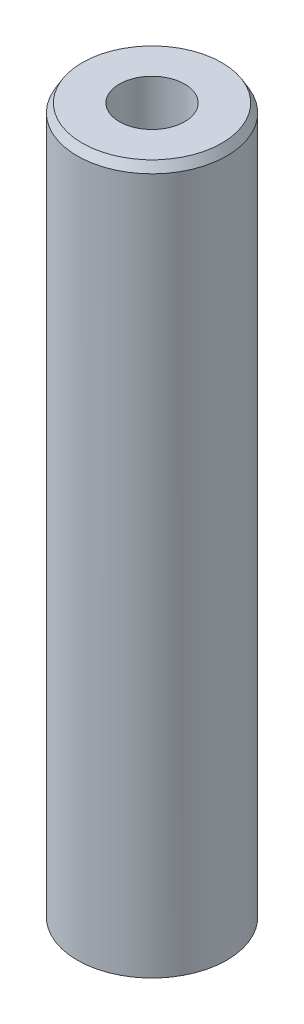
ISO-10303-21;
HEADER;
FILE_DESCRIPTION(('STEP AP214'),'2;1');
FILE_NAME('part.step','',(''),(''),'','','');
FILE_SCHEMA(('AUTOMOTIVE_DESIGN { 1 0 10303 214 1 1 1 1 }'));
ENDSEC;
DATA;
#1=APPLICATION_CONTEXT('core data for automotive mechanical design processes');
#2=APPLICATION_PROTOCOL_DEFINITION('international standard','automotive_design',2000,#1);
#3=PRODUCT_CONTEXT('',#1,'mechanical');
#4=PRODUCT('Part','Part','',(#3));
#5=PRODUCT_RELATED_PRODUCT_CATEGORY('part','',(#4));
#6=PRODUCT_DEFINITION_FORMATION('','',#4);
#7=PRODUCT_DEFINITION_CONTEXT('part definition',#1,'design');
#8=PRODUCT_DEFINITION('design','',#6,#7);
#9=PRODUCT_DEFINITION_SHAPE('','',#8);
#10=(LENGTH_UNIT() NAMED_UNIT(*) SI_UNIT(.MILLI.,.METRE.));
#11=(NAMED_UNIT(*) PLANE_ANGLE_UNIT() SI_UNIT($,.RADIAN.));
#12=(NAMED_UNIT(*) SI_UNIT($,.STERADIAN.) SOLID_ANGLE_UNIT());
#13=UNCERTAINTY_MEASURE_WITH_UNIT(LENGTH_MEASURE(1.E-05),#10,'distance_accuracy_value','');
#14=(GEOMETRIC_REPRESENTATION_CONTEXT(3) GLOBAL_UNCERTAINTY_ASSIGNED_CONTEXT((#13)) GLOBAL_UNIT_ASSIGNED_CONTEXT((#10,
#11,#12)) REPRESENTATION_CONTEXT('',''));
#15=CARTESIAN_POINT('',(0.,0.,0.));
#16=DIRECTION('',(0.,0.,1.));
#17=DIRECTION('',(1.,0.,0.));
#18=AXIS2_PLACEMENT_3D('',#15,#16,#17);
#19=CARTESIAN_POINT('',(0.,427.403267792067,0.));
#20=DIRECTION('',(0.,-1.,0.));
#21=DIRECTION('',(0.,0.,-1.));
#22=AXIS2_PLACEMENT_3D('',#19,#20,#21);
#23=CYLINDRICAL_SURFACE('',#22,45.);
#24=CARTESIAN_POINT('',(0.,422.217168382494,0.));
#25=DIRECTION('',(0.,1.,0.));
#26=DIRECTION('',(0.,0.,1.));
#27=AXIS2_PLACEMENT_3D('',#24,#25,#26);
#28=CIRCLE('',#27,45.);
#29=CARTESIAN_POINT('',(0.,422.217168382494,-45.));
#30=VERTEX_POINT('',#29);
#31=EDGE_CURVE('E50',#30,#30,#28,.F.);
#32=CARTESIAN_POINT('',(0.,2.99419589016137,0.));
#33=DIRECTION('',(0.,1.,0.));
#34=DIRECTION('',(0.,0.,1.));
#35=AXIS2_PLACEMENT_3D('',#32,#33,#34);
#36=CIRCLE('',#35,45.);
#37=CARTESIAN_POINT('',(0.,2.99419589016131,-45.));
#38=VERTEX_POINT('',#37);
#39=EDGE_CURVE('E51',#38,#38,#36,.T.);
#40=CARTESIAN_POINT('',(0.,422.217168382494,-45.));
#41=CARTESIAN_POINT('',(0.,417.850262419032,-45.));
#42=CARTESIAN_POINT('',(0.,413.48335645557,-45.));
#43=CARTESIAN_POINT('',(0.,404.749544528646,-45.));
#44=CARTESIAN_POINT('',(0.,400.382638565185,-45.));
#45=CARTESIAN_POINT('',(0.,391.648826638261,-45.));
#46=CARTESIAN_POINT('',(0.,387.281920674799,-45.));
#47=CARTESIAN_POINT('',(0.,378.548108747876,-45.));
#48=CARTESIAN_POINT('',(0.,374.181202784414,-45.));
#49=CARTESIAN_POINT('',(0.,365.44739085749,-45.));
#50=CARTESIAN_POINT('',(0.,361.080484894028,-45.));
#51=CARTESIAN_POINT('',(0.,352.346672967105,-45.));
#52=CARTESIAN_POINT('',(0.,347.979767003643,-45.));
#53=CARTESIAN_POINT('',(0.,339.245955076719,-45.));
#54=CARTESIAN_POINT('',(0.,334.879049113258,-45.));
#55=CARTESIAN_POINT('',(0.,326.145237186334,-45.));
#56=CARTESIAN_POINT('',(0.,321.778331222872,-45.));
#57=CARTESIAN_POINT('',(0.,313.044519295949,-45.));
#58=CARTESIAN_POINT('',(0.,308.677613332487,-45.));
#59=CARTESIAN_POINT('',(0.,299.943801405563,-45.));
#60=CARTESIAN_POINT('',(0.,295.576895442101,-45.));
#61=CARTESIAN_POINT('',(0.,286.843083515178,-45.));
#62=CARTESIAN_POINT('',(0.,282.476177551716,-45.));
#63=CARTESIAN_POINT('',(0.,273.742365624793,-45.));
#64=CARTESIAN_POINT('',(0.,269.375459661331,-45.));
#65=CARTESIAN_POINT('',(0.,260.641647734407,-45.));
#66=CARTESIAN_POINT('',(0.,256.274741770945,-45.));
#67=CARTESIAN_POINT('',(0.,247.540929844022,-45.));
#68=CARTESIAN_POINT('',(0.,243.17402388056,-45.));
#69=CARTESIAN_POINT('',(0.,234.440211953636,-45.));
#70=CARTESIAN_POINT('',(0.,230.073305990175,-45.));
#71=CARTESIAN_POINT('',(0.,221.339494063251,-45.));
#72=CARTESIAN_POINT('',(0.,216.972588099789,-45.));
#73=CARTESIAN_POINT('',(0.,208.238776172866,-45.));
#74=CARTESIAN_POINT('',(0.,203.871870209404,-45.));
#75=CARTESIAN_POINT('',(0.,195.13805828248,-45.));
#76=CARTESIAN_POINT('',(0.,190.771152319018,-45.));
#77=CARTESIAN_POINT('',(0.,182.037340392095,-45.));
#78=CARTESIAN_POINT('',(0.,177.670434428633,-45.));
#79=CARTESIAN_POINT('',(0.,168.93662250171,-45.));
#80=CARTESIAN_POINT('',(0.,164.569716538248,-45.));
#81=CARTESIAN_POINT('',(0.,155.835904611324,-45.));
#82=CARTESIAN_POINT('',(0.,151.468998647862,-45.));
#83=CARTESIAN_POINT('',(0.,142.735186720939,-45.));
#84=CARTESIAN_POINT('',(0.,138.368280757477,-45.));
#85=CARTESIAN_POINT('',(0.,129.634468830553,-45.));
#86=CARTESIAN_POINT('',(0.,125.267562867092,-45.));
#87=CARTESIAN_POINT('',(0.,116.533750940168,-45.));
#88=CARTESIAN_POINT('',(0.,112.166844976706,-45.));
#89=CARTESIAN_POINT('',(0.,103.433033049783,-45.));
#90=CARTESIAN_POINT('',(0.,99.0661270863208,-45.));
#91=CARTESIAN_POINT('',(0.,90.3323151593972,-45.));
#92=CARTESIAN_POINT('',(0.,85.9654091959354,-45.));
#93=CARTESIAN_POINT('',(0.,77.2315972690118,-45.));
#94=CARTESIAN_POINT('',(0.,72.86469130555,-45.));
#95=CARTESIAN_POINT('',(0.,64.1308793786264,-45.));
#96=CARTESIAN_POINT('',(0.,59.7639734151646,-45.));
#97=CARTESIAN_POINT('',(0.,51.0301614882411,-45.));
#98=CARTESIAN_POINT('',(0.,46.6632555247793,-45.));
#99=CARTESIAN_POINT('',(0.,37.9294435978557,-45.));
#100=CARTESIAN_POINT('',(0.,33.5625376343939,-45.));
#101=CARTESIAN_POINT('',(0.,24.8287257074703,-45.));
#102=CARTESIAN_POINT('',(0.,20.4618197440085,-45.));
#103=CARTESIAN_POINT('',(0.,11.7280078170849,-45.));
#104=CARTESIAN_POINT('',(0.,7.3611018536231,-45.));
#105=CARTESIAN_POINT('',(0.,2.99419589016131,-45.));
#106=B_SPLINE_CURVE_WITH_KNOTS('',3,(#40,#41,#42,#43,#44,#45,#46,#47,#48,#49,#50,#51,#52,#53,
#54,#55,#56,#57,#58,#59,#60,#61,#62,#63,#64,#65,#66,#67,#68,#69,#70,#71,#72,#73,#74,#75,#76,#77,
#78,#79,#80,#81,#82,#83,#84,#85,#86,#87,#88,#89,#90,#91,#92,#93,#94,#95,#96,#97,#98,#99,#100,
#101,#102,#103,#104,#105),.UNSPECIFIED.,.F.,.F.,(4,2,2,2,2,2,2,2,2,2,2,2,2,2,2,2,2,2,2,2,2,2,2,
2,2,2,2,2,2,2,2,2,4),(0.,13.1007178903854,26.2014357807708,39.3021536711561,52.4028715615416,
65.5035894519269,78.6043073423123,91.7050252326977,104.805743123083,117.906461013468,
131.007178903854,144.107896794239,157.208614684625,170.30933257501,183.410050465395,
196.510768355781,209.611486246166,222.712204136551,235.812922026937,248.913639917322,
262.014357807708,275.115075698093,288.215793588478,301.316511478864,314.417229369249,
327.517947259634,340.61866515002,353.719383040405,366.820100930791,379.920818821176,
393.021536711561,406.122254601947,419.222972492332),.UNSPECIFIED.);
#107=EDGE_CURVE('BSEAM39',#30,#38,#106,.T.);
#108=ORIENTED_EDGE('',*,*,#31,.T.);
#109=ORIENTED_EDGE('',*,*,#39,.T.);
#110=ORIENTED_EDGE('',*,*,#107,.T.);
#111=ORIENTED_EDGE('',*,*,#107,.F.);
#112=EDGE_LOOP('',(#108,#110,#109,#111));
#113=FACE_BOUND('',#112,.T.);
#114=ADVANCED_FACE('F39',(#113),#23,.T.);
#115=CARTESIAN_POINT('',(0.,427.403267792067,0.));
#116=DIRECTION('',(0.,1.,0.));
#117=DIRECTION('',(0.,0.,1.));
#118=AXIS2_PLACEMENT_3D('',#115,#116,#117);
#119=PLANE('',#118);
#120=CARTESIAN_POINT('',(0.,427.403267792067,0.));
#121=DIRECTION('',(0.,1.,0.));
#122=DIRECTION('',(0.,0.,1.));
#123=AXIS2_PLACEMENT_3D('',#120,#121,#122);
#124=CIRCLE('',#123,42.0058041098389);
#125=CARTESIAN_POINT('',(0.,427.403267792067,42.0058041098389));
#126=VERTEX_POINT('',#125);
#127=EDGE_CURVE('E54',#126,#126,#124,.T.);
#128=ORIENTED_EDGE('',*,*,#127,.T.);
#129=EDGE_LOOP('',(#128));
#130=FACE_BOUND('',#129,.T.);
#131=CARTESIAN_POINT('',(0.,427.403267792067,0.));
#132=DIRECTION('',(0.,1.,0.));
#133=DIRECTION('',(0.,0.,1.));
#134=AXIS2_PLACEMENT_3D('',#131,#132,#133);
#135=CIRCLE('',#134,19.650964063368);
#136=CARTESIAN_POINT('',(0.,427.403267792067,-19.650964063368));
#137=VERTEX_POINT('',#136);
#138=EDGE_CURVE('E58',#137,#137,#135,.T.);
#139=ORIENTED_EDGE('',*,*,#138,.F.);
#140=EDGE_LOOP('',(#139));
#141=FACE_BOUND('',#140,.T.);
#142=ADVANCED_FACE('F69',(#130,#141),#119,.T.);
#143=CARTESIAN_POINT('',(0.,0.,0.));
#144=DIRECTION('',(0.,1.,0.));
#145=DIRECTION('',(0.,0.,1.));
#146=AXIS2_PLACEMENT_3D('',#143,#144,#145);
#147=PLANE('',#146);
#148=CARTESIAN_POINT('',(0.,0.,0.));
#149=DIRECTION('',(0.,1.,0.));
#150=DIRECTION('',(0.,0.,1.));
#151=AXIS2_PLACEMENT_3D('',#148,#149,#150);
#152=CIRCLE('',#151,39.8139005904265);
#153=CARTESIAN_POINT('',(0.,0.,39.8139005904265));
#154=VERTEX_POINT('',#153);
#155=EDGE_CURVE('E10',#154,#154,#152,.F.);
#156=ORIENTED_EDGE('',*,*,#155,.T.);
#157=EDGE_LOOP('',(#156));
#158=FACE_BOUND('',#157,.T.);
#159=CARTESIAN_POINT('',(0.,0.,0.));
#160=DIRECTION('',(0.,1.,0.));
#161=DIRECTION('',(0.,0.,1.));
#162=AXIS2_PLACEMENT_3D('',#159,#160,#161);
#163=CIRCLE('',#162,19.650964063368);
#164=CARTESIAN_POINT('',(0.,0.,-19.650964063368));
#165=VERTEX_POINT('',#164);
#166=EDGE_CURVE('E63',#165,#165,#163,.T.);
#167=ORIENTED_EDGE('',*,*,#166,.T.);
#168=EDGE_LOOP('',(#167));
#169=FACE_BOUND('',#168,.T.);
#170=ADVANCED_FACE('F75',(#158,#169),#147,.F.);
#171=CARTESIAN_POINT('',(0.,427.403267792067,0.));
#172=DIRECTION('',(0.,-1.,0.));
#173=DIRECTION('',(0.,0.,-1.));
#174=AXIS2_PLACEMENT_3D('',#171,#172,#173);
#175=CYLINDRICAL_SURFACE('',#174,19.650964063368);
#176=CARTESIAN_POINT('',(0.,427.403267792067,-19.650964063368));
#177=CARTESIAN_POINT('',(0.,422.951150419232,-19.650964063368));
#178=CARTESIAN_POINT('',(0.,418.499033046398,-19.650964063368));
#179=CARTESIAN_POINT('',(0.,409.59479830073,-19.650964063368));
#180=CARTESIAN_POINT('',(0.,405.142680927896,-19.650964063368));
#181=CARTESIAN_POINT('',(0.,396.238446182228,-19.650964063368));
#182=CARTESIAN_POINT('',(0.,391.786328809394,-19.650964063368));
#183=CARTESIAN_POINT('',(0.,382.882094063726,-19.650964063368));
#184=CARTESIAN_POINT('',(0.,378.429976690892,-19.650964063368));
#185=CARTESIAN_POINT('',(0.,369.525741945224,-19.650964063368));
#186=CARTESIAN_POINT('',(0.,365.07362457239,-19.650964063368));
#187=CARTESIAN_POINT('',(0.,356.169389826722,-19.650964063368));
#188=CARTESIAN_POINT('',(0.,351.717272453888,-19.650964063368));
#189=CARTESIAN_POINT('',(0.,342.81303770822,-19.650964063368));
#190=CARTESIAN_POINT('',(0.,338.360920335386,-19.650964063368));
#191=CARTESIAN_POINT('',(0.,329.456685589718,-19.650964063368));
#192=CARTESIAN_POINT('',(0.,325.004568216884,-19.650964063368));
#193=CARTESIAN_POINT('',(0.,316.100333471216,-19.650964063368));
#194=CARTESIAN_POINT('',(0.,311.648216098382,-19.650964063368));
#195=CARTESIAN_POINT('',(0.,302.743981352714,-19.650964063368));
#196=CARTESIAN_POINT('',(0.,298.29186397988,-19.650964063368));
#197=CARTESIAN_POINT('',(0.,289.387629234212,-19.650964063368));
#198=CARTESIAN_POINT('',(0.,284.935511861378,-19.650964063368));
#199=CARTESIAN_POINT('',(0.,276.03127711571,-19.650964063368));
#200=CARTESIAN_POINT('',(0.,271.579159742876,-19.650964063368));
#201=CARTESIAN_POINT('',(0.,262.674924997208,-19.650964063368));
#202=CARTESIAN_POINT('',(0.,258.222807624373,-19.650964063368));
#203=CARTESIAN_POINT('',(0.,249.318572878705,-19.650964063368));
#204=CARTESIAN_POINT('',(0.,244.866455505871,-19.650964063368));
#205=CARTESIAN_POINT('',(0.,235.962220760203,-19.650964063368));
#206=CARTESIAN_POINT('',(0.,231.510103387369,-19.650964063368));
#207=CARTESIAN_POINT('',(0.,222.605868641701,-19.650964063368));
#208=CARTESIAN_POINT('',(0.,218.153751268867,-19.650964063368));
#209=CARTESIAN_POINT('',(0.,209.249516523199,-19.650964063368));
#210=CARTESIAN_POINT('',(0.,204.797399150365,-19.650964063368));
#211=CARTESIAN_POINT('',(0.,195.893164404697,-19.650964063368));
#212=CARTESIAN_POINT('',(0.,191.441047031863,-19.650964063368));
#213=CARTESIAN_POINT('',(0.,182.536812286195,-19.650964063368));
#214=CARTESIAN_POINT('',(0.,178.084694913361,-19.650964063368));
#215=CARTESIAN_POINT('',(0.,169.180460167693,-19.650964063368));
#216=CARTESIAN_POINT('',(0.,164.728342794859,-19.650964063368));
#217=CARTESIAN_POINT('',(0.,155.824108049191,-19.650964063368));
#218=CARTESIAN_POINT('',(0.,151.371990676357,-19.650964063368));
#219=CARTESIAN_POINT('',(0.,142.467755930689,-19.650964063368));
#220=CARTESIAN_POINT('',(0.,138.015638557855,-19.650964063368));
#221=CARTESIAN_POINT('',(0.,129.111403812187,-19.650964063368));
#222=CARTESIAN_POINT('',(0.,124.659286439353,-19.650964063368));
#223=CARTESIAN_POINT('',(0.,115.755051693685,-19.650964063368));
#224=CARTESIAN_POINT('',(0.,111.302934320851,-19.650964063368));
#225=CARTESIAN_POINT('',(0.,102.398699575183,-19.650964063368));
#226=CARTESIAN_POINT('',(0.,97.9465822023486,-19.650964063368));
#227=CARTESIAN_POINT('',(0.,89.0423474566805,-19.650964063368));
#228=CARTESIAN_POINT('',(0.,84.5902300838465,-19.650964063368));
#229=CARTESIAN_POINT('',(0.,75.6859953381784,-19.650964063368));
#230=CARTESIAN_POINT('',(0.,71.2338779653444,-19.650964063368));
#231=CARTESIAN_POINT('',(0.,62.3296432196763,-19.650964063368));
#232=CARTESIAN_POINT('',(0.,57.8775258468423,-19.650964063368));
#233=CARTESIAN_POINT('',(0.,48.9732911011742,-19.650964063368));
#234=CARTESIAN_POINT('',(0.,44.5211737283402,-19.650964063368));
#235=CARTESIAN_POINT('',(0.,35.6169389826722,-19.650964063368));
#236=CARTESIAN_POINT('',(0.,31.1648216098381,-19.650964063368));
#237=CARTESIAN_POINT('',(0.,22.2605868641701,-19.650964063368));
#238=CARTESIAN_POINT('',(0.,17.808469491336,-19.650964063368));
#239=CARTESIAN_POINT('',(0.,8.90423474566798,-19.650964063368));
#240=CARTESIAN_POINT('',(0.,4.45211737283397,-19.650964063368));
#241=CARTESIAN_POINT('',(0.,0.,-19.650964063368));
#242=B_SPLINE_CURVE_WITH_KNOTS('',3,(#176,#177,#178,#179,#180,#181,#182,#183,#184,#185,#186,
#187,#188,#189,#190,#191,#192,#193,#194,#195,#196,#197,#198,#199,#200,#201,#202,#203,#204,#205,
#206,#207,#208,#209,#210,#211,#212,#213,#214,#215,#216,#217,#218,#219,#220,#221,#222,#223,#224,
#225,#226,#227,#228,#229,#230,#231,#232,#233,#234,#235,#236,#237,#238,#239,#240,#241),
.UNSPECIFIED.,.F.,.F.,(4,2,2,2,2,2,2,2,2,2,2,2,2,2,2,2,2,2,2,2,2,2,2,2,2,2,2,2,2,2,2,2,4),(0.,
13.3563521185021,26.7127042370042,40.0690563555063,53.4254084740083,66.7817605925104,
80.1381127110125,93.4944648295146,106.850816948017,120.207169066519,133.563521185021,
146.919873303523,160.276225422025,173.632577540527,186.988929659029,200.345281777531,
213.701633896033,227.057986014535,240.414338133037,253.770690251539,267.127042370042,
280.483394488544,293.839746607046,307.196098725548,320.55245084405,333.908802962552,
347.265155081054,360.621507199556,373.977859318058,387.33421143656,400.690563555062,
414.046915673565,427.403267792067),.UNSPECIFIED.);
#243=EDGE_CURVE('BSEAM70',#137,#165,#242,.T.);
#244=ORIENTED_EDGE('',*,*,#138,.T.);
#245=ORIENTED_EDGE('',*,*,#166,.F.);
#246=ORIENTED_EDGE('',*,*,#243,.T.);
#247=ORIENTED_EDGE('',*,*,#243,.F.);
#248=EDGE_LOOP('',(#244,#246,#245,#247));
#249=FACE_BOUND('',#248,.T.);
#250=ADVANCED_FACE('F70',(#249),#175,.F.);
#251=CARTESIAN_POINT('',(0.,427.403267792067,0.));
#252=DIRECTION('',(0.,-1.,0.));
#253=DIRECTION('',(0.,0.,-1.));
#254=AXIS2_PLACEMENT_3D('',#251,#252,#253);
#255=CONICAL_SURFACE('',#254,42.0058041098389,0.523598775598298);
#256=ORIENTED_EDGE('',*,*,#31,.F.);
#257=EDGE_LOOP('',(#256));
#258=FACE_BOUND('',#257,.T.);
#259=ORIENTED_EDGE('',*,*,#127,.F.);
#260=EDGE_LOOP('',(#259));
#261=FACE_BOUND('',#260,.T.);
#262=ADVANCED_FACE('F81',(#258,#261),#255,.T.);
#263=CARTESIAN_POINT('',(0.,2.99419589016137,0.));
#264=DIRECTION('',(0.,1.,0.));
#265=DIRECTION('',(0.,0.,1.));
#266=AXIS2_PLACEMENT_3D('',#263,#264,#265);
#267=CONICAL_SURFACE('',#266,45.,1.0471975511966);
#268=ORIENTED_EDGE('',*,*,#155,.F.);
#269=EDGE_LOOP('',(#268));
#270=FACE_BOUND('',#269,.T.);
#271=ORIENTED_EDGE('',*,*,#39,.F.);
#272=EDGE_LOOP('',(#271));
#273=FACE_BOUND('',#272,.T.);
#274=ADVANCED_FACE('F45',(#270,#273),#267,.T.);
#275=CLOSED_SHELL('',(#114,#142,#170,#250,#262,#274));
#276=MANIFOLD_SOLID_BREP('B2',#275);
#277=ADVANCED_BREP_SHAPE_REPRESENTATION('',(#18,#276),#14);
#278=SHAPE_DEFINITION_REPRESENTATION(#9,#277);
ENDSEC;
END-ISO-10303-21;
